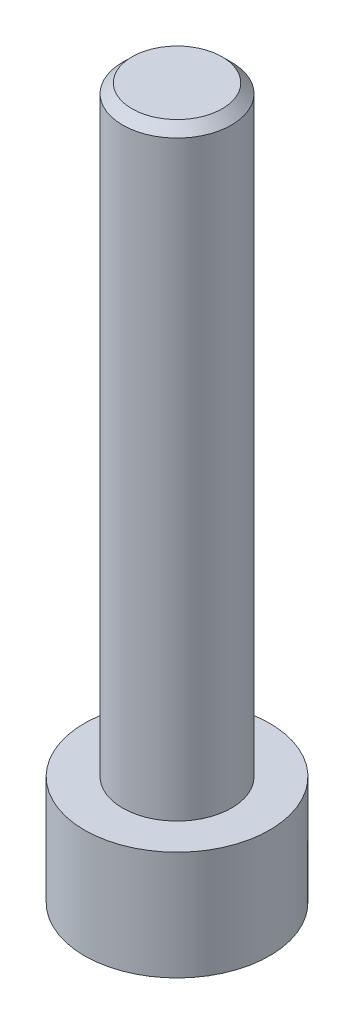
ISO-10303-21;
HEADER;
FILE_DESCRIPTION(('STEP AP214'),'2;1');
FILE_NAME('part.step','',(''),(''),'','','');
FILE_SCHEMA(('AUTOMOTIVE_DESIGN { 1 0 10303 214 1 1 1 1 }'));
ENDSEC;
DATA;
#1=APPLICATION_CONTEXT('core data for automotive mechanical design processes');
#2=APPLICATION_PROTOCOL_DEFINITION('international standard','automotive_design',2000,#1);
#3=PRODUCT_CONTEXT('',#1,'mechanical');
#4=PRODUCT('Part','Part','',(#3));
#5=PRODUCT_RELATED_PRODUCT_CATEGORY('part','',(#4));
#6=PRODUCT_DEFINITION_FORMATION('','',#4);
#7=PRODUCT_DEFINITION_CONTEXT('part definition',#1,'design');
#8=PRODUCT_DEFINITION('design','',#6,#7);
#9=PRODUCT_DEFINITION_SHAPE('','',#8);
#10=(LENGTH_UNIT() NAMED_UNIT(*) SI_UNIT(.MILLI.,.METRE.));
#11=(NAMED_UNIT(*) PLANE_ANGLE_UNIT() SI_UNIT($,.RADIAN.));
#12=(NAMED_UNIT(*) SI_UNIT($,.STERADIAN.) SOLID_ANGLE_UNIT());
#13=UNCERTAINTY_MEASURE_WITH_UNIT(LENGTH_MEASURE(1.E-05),#10,'distance_accuracy_value','');
#14=(GEOMETRIC_REPRESENTATION_CONTEXT(3) GLOBAL_UNCERTAINTY_ASSIGNED_CONTEXT((#13)) GLOBAL_UNIT_ASSIGNED_CONTEXT((#10,
#11,#12)) REPRESENTATION_CONTEXT('',''));
#15=CARTESIAN_POINT('',(0.,0.,0.));
#16=DIRECTION('',(0.,0.,1.));
#17=DIRECTION('',(1.,0.,0.));
#18=AXIS2_PLACEMENT_3D('',#15,#16,#17);
#19=CARTESIAN_POINT('',(0.,2.9,0.));
#20=DIRECTION('',(0.,-1.,0.));
#21=DIRECTION('',(0.,0.,-1.));
#22=AXIS2_PLACEMENT_3D('',#19,#20,#21);
#23=CYLINDRICAL_SURFACE('',#22,2.465);
#24=CARTESIAN_POINT('',(0.,2.9,0.));
#25=DIRECTION('',(0.,1.,0.));
#26=DIRECTION('',(0.,0.,1.));
#27=AXIS2_PLACEMENT_3D('',#24,#25,#26);
#28=CIRCLE('',#27,2.465);
#29=CARTESIAN_POINT('',(0.,2.9,2.465));
#30=VERTEX_POINT('',#29);
#31=EDGE_CURVE('E177',#30,#30,#28,.T.);
#32=ORIENTED_EDGE('',*,*,#31,.F.);
#33=EDGE_LOOP('',(#32));
#34=FACE_BOUND('',#33,.T.);
#35=CARTESIAN_POINT('',(0.,0.,0.));
#36=DIRECTION('',(0.,1.,0.));
#37=DIRECTION('',(0.,0.,1.));
#38=AXIS2_PLACEMENT_3D('',#35,#36,#37);
#39=CIRCLE('',#38,2.465);
#40=CARTESIAN_POINT('',(0.,0.,2.465));
#41=VERTEX_POINT('',#40);
#42=EDGE_CURVE('E163',#41,#41,#39,.T.);
#43=ORIENTED_EDGE('',*,*,#42,.T.);
#44=EDGE_LOOP('',(#43));
#45=FACE_BOUND('',#44,.T.);
#46=ADVANCED_FACE('F47',(#34,#45),#23,.T.);
#47=CARTESIAN_POINT('',(0.,2.9,0.));
#48=DIRECTION('',(0.,1.,0.));
#49=DIRECTION('',(0.,0.,1.));
#50=AXIS2_PLACEMENT_3D('',#47,#48,#49);
#51=PLANE('',#50);
#52=CARTESIAN_POINT('',(0.,2.9,0.));
#53=DIRECTION('',(0.,1.,0.));
#54=DIRECTION('',(0.,0.,1.));
#55=AXIS2_PLACEMENT_3D('',#52,#53,#54);
#56=CIRCLE('',#55,1.45);
#57=CARTESIAN_POINT('',(0.,2.9,1.45));
#58=VERTEX_POINT('',#57);
#59=EDGE_CURVE('E173',#58,#58,#56,.T.);
#60=ORIENTED_EDGE('',*,*,#59,.F.);
#61=EDGE_LOOP('',(#60));
#62=FACE_BOUND('',#61,.T.);
#63=ORIENTED_EDGE('',*,*,#31,.T.);
#64=EDGE_LOOP('',(#63));
#65=FACE_BOUND('',#64,.T.);
#66=ADVANCED_FACE('F199',(#62,#65),#51,.T.);
#67=CARTESIAN_POINT('',(0.,0.,0.));
#68=DIRECTION('',(0.,1.,0.));
#69=DIRECTION('',(0.,0.,1.));
#70=AXIS2_PLACEMENT_3D('',#67,#68,#69);
#71=PLANE('',#70);
#72=DIRECTION('',(0.5,0.,0.866025403784439));
#73=VECTOR('',#72,1.);
#74=CARTESIAN_POINT('',(0.733234841870825,0.,-1.27));
#75=LINE('',#74,#73);
#76=CARTESIAN_POINT('',(0.733234841870825,0.,-1.27));
#77=VERTEX_POINT('',#76);
#78=CARTESIAN_POINT('',(1.46646968374165,0.,0.));
#79=VERTEX_POINT('',#78);
#80=EDGE_CURVE('E144',#77,#79,#75,.T.);
#81=ORIENTED_EDGE('',*,*,#80,.F.);
#82=DIRECTION('',(1.,0.,0.));
#83=VECTOR('',#82,1.);
#84=CARTESIAN_POINT('',(-0.733234841870825,0.,-1.27));
#85=LINE('',#84,#83);
#86=CARTESIAN_POINT('',(-0.733234841870825,0.,-1.27));
#87=VERTEX_POINT('',#86);
#88=EDGE_CURVE('E64',#87,#77,#85,.T.);
#89=ORIENTED_EDGE('',*,*,#88,.F.);
#90=DIRECTION('',(0.5,0.,-0.866025403784438));
#91=VECTOR('',#90,1.);
#92=CARTESIAN_POINT('',(-1.46646968374165,0.,0.));
#93=LINE('',#92,#91);
#94=CARTESIAN_POINT('',(-1.46646968374165,0.,0.));
#95=VERTEX_POINT('',#94);
#96=EDGE_CURVE('E157',#95,#87,#93,.T.);
#97=ORIENTED_EDGE('',*,*,#96,.F.);
#98=DIRECTION('',(-0.5,0.,-0.866025403784439));
#99=VECTOR('',#98,1.);
#100=CARTESIAN_POINT('',(-0.733234841870825,0.,1.27));
#101=LINE('',#100,#99);
#102=CARTESIAN_POINT('',(-0.733234841870825,0.,1.27));
#103=VERTEX_POINT('',#102);
#104=EDGE_CURVE('E154',#103,#95,#101,.T.);
#105=ORIENTED_EDGE('',*,*,#104,.F.);
#106=DIRECTION('',(-1.,0.,0.));
#107=VECTOR('',#106,1.);
#108=CARTESIAN_POINT('',(0.733234841870825,0.,1.27));
#109=LINE('',#108,#107);
#110=CARTESIAN_POINT('',(0.733234841870825,0.,1.27));
#111=VERTEX_POINT('',#110);
#112=EDGE_CURVE('E112',#111,#103,#109,.T.);
#113=ORIENTED_EDGE('',*,*,#112,.F.);
#114=DIRECTION('',(-0.5,0.,0.866025403784439));
#115=VECTOR('',#114,1.);
#116=CARTESIAN_POINT('',(1.46646968374165,0.,0.));
#117=LINE('',#116,#115);
#118=EDGE_CURVE('E148',#79,#111,#117,.T.);
#119=ORIENTED_EDGE('',*,*,#118,.F.);
#120=EDGE_LOOP('',(#81,#89,#97,#105,#113,#119));
#121=FACE_BOUND('',#120,.T.);
#122=ORIENTED_EDGE('',*,*,#42,.F.);
#123=EDGE_LOOP('',(#122));
#124=FACE_BOUND('',#123,.T.);
#125=ADVANCED_FACE('F204',(#121,#124),#71,.F.);
#126=CARTESIAN_POINT('',(0.,18.9,0.));
#127=DIRECTION('',(0.,-1.,0.));
#128=DIRECTION('',(0.,0.,-1.));
#129=AXIS2_PLACEMENT_3D('',#126,#127,#128);
#130=CYLINDRICAL_SURFACE('',#129,1.45);
#131=CARTESIAN_POINT('',(0.,18.65,0.));
#132=DIRECTION('',(0.,1.,0.));
#133=DIRECTION('',(0.,0.,1.));
#134=AXIS2_PLACEMENT_3D('',#131,#132,#133);
#135=CIRCLE('',#134,1.45);
#136=CARTESIAN_POINT('',(0.,18.65,1.45));
#137=VERTEX_POINT('',#136);
#138=EDGE_CURVE('E11',#137,#137,#135,.F.);
#139=ORIENTED_EDGE('',*,*,#138,.T.);
#140=EDGE_LOOP('',(#139));
#141=FACE_BOUND('',#140,.T.);
#142=ORIENTED_EDGE('',*,*,#59,.T.);
#143=EDGE_LOOP('',(#142));
#144=FACE_BOUND('',#143,.T.);
#145=ADVANCED_FACE('F211',(#141,#144),#130,.T.);
#146=CARTESIAN_POINT('',(0.,18.9,0.));
#147=DIRECTION('',(0.,1.,0.));
#148=DIRECTION('',(0.,0.,1.));
#149=AXIS2_PLACEMENT_3D('',#146,#147,#148);
#150=PLANE('',#149);
#151=CARTESIAN_POINT('',(0.,18.9,0.));
#152=DIRECTION('',(0.,1.,0.));
#153=DIRECTION('',(0.,0.,1.));
#154=AXIS2_PLACEMENT_3D('',#151,#152,#153);
#155=CIRCLE('',#154,1.2);
#156=CARTESIAN_POINT('',(0.,18.9,1.2));
#157=VERTEX_POINT('',#156);
#158=EDGE_CURVE('E57',#157,#157,#155,.T.);
#159=ORIENTED_EDGE('',*,*,#158,.T.);
#160=EDGE_LOOP('',(#159));
#161=FACE_BOUND('',#160,.T.);
#162=ADVANCED_FACE('F187',(#161),#150,.T.);
#163=CARTESIAN_POINT('',(-0.733234841870825,1.9,-1.27));
#164=DIRECTION('',(0.,0.,-1.));
#165=DIRECTION('',(-1.,0.,0.));
#166=AXIS2_PLACEMENT_3D('',#163,#164,#165);
#167=PLANE('',#166);
#168=ORIENTED_EDGE('',*,*,#88,.T.);
#169=DIRECTION('',(0.,-1.,0.));
#170=VECTOR('',#169,1.);
#171=CARTESIAN_POINT('',(0.733234841870825,1.9,-1.27));
#172=LINE('',#171,#170);
#173=CARTESIAN_POINT('',(0.733234841870825,1.9,-1.27));
#174=VERTEX_POINT('',#173);
#175=EDGE_CURVE('E94',#174,#77,#172,.T.);
#176=ORIENTED_EDGE('',*,*,#175,.F.);
#177=DIRECTION('',(1.,0.,0.));
#178=VECTOR('',#177,1.);
#179=CARTESIAN_POINT('',(-0.733234841870825,1.9,-1.27));
#180=LINE('',#179,#178);
#181=CARTESIAN_POINT('',(-0.733234841870825,1.9,-1.27));
#182=VERTEX_POINT('',#181);
#183=EDGE_CURVE('E160',#182,#174,#180,.T.);
#184=ORIENTED_EDGE('',*,*,#183,.F.);
#185=DIRECTION('',(0.,-1.,0.));
#186=VECTOR('',#185,1.);
#187=CARTESIAN_POINT('',(-0.733234841870825,1.9,-1.27));
#188=LINE('',#187,#186);
#189=EDGE_CURVE('E72',#182,#87,#188,.T.);
#190=ORIENTED_EDGE('',*,*,#189,.T.);
#191=EDGE_LOOP('',(#168,#176,#184,#190));
#192=FACE_BOUND('',#191,.T.);
#193=ADVANCED_FACE('F218',(#192),#167,.F.);
#194=CARTESIAN_POINT('',(-1.46646968374165,1.9,0.));
#195=DIRECTION('',(-0.866025403784439,0.,-0.5));
#196=DIRECTION('',(-0.5,0.,0.866025403784439));
#197=AXIS2_PLACEMENT_3D('',#194,#195,#196);
#198=PLANE('',#197);
#199=ORIENTED_EDGE('',*,*,#96,.T.);
#200=ORIENTED_EDGE('',*,*,#189,.F.);
#201=DIRECTION('',(0.5,0.,-0.866025403784438));
#202=VECTOR('',#201,1.);
#203=CARTESIAN_POINT('',(-1.46646968374165,1.9,0.));
#204=LINE('',#203,#202);
#205=CARTESIAN_POINT('',(-1.46646968374165,1.9,0.));
#206=VERTEX_POINT('',#205);
#207=EDGE_CURVE('E126',#206,#182,#204,.T.);
#208=ORIENTED_EDGE('',*,*,#207,.F.);
#209=DIRECTION('',(0.,-1.,0.));
#210=VECTOR('',#209,1.);
#211=CARTESIAN_POINT('',(-1.46646968374165,1.9,0.));
#212=LINE('',#211,#210);
#213=EDGE_CURVE('E117',#206,#95,#212,.T.);
#214=ORIENTED_EDGE('',*,*,#213,.T.);
#215=EDGE_LOOP('',(#199,#200,#208,#214));
#216=FACE_BOUND('',#215,.T.);
#217=ADVANCED_FACE('F221',(#216),#198,.F.);
#218=CARTESIAN_POINT('',(-0.733234841870825,1.9,1.27));
#219=DIRECTION('',(-0.866025403784438,0.,0.5));
#220=DIRECTION('',(0.5,0.,0.866025403784439));
#221=AXIS2_PLACEMENT_3D('',#218,#219,#220);
#222=PLANE('',#221);
#223=ORIENTED_EDGE('',*,*,#104,.T.);
#224=ORIENTED_EDGE('',*,*,#213,.F.);
#225=DIRECTION('',(-0.5,0.,-0.866025403784439));
#226=VECTOR('',#225,1.);
#227=CARTESIAN_POINT('',(-0.733234841870825,1.9,1.27));
#228=LINE('',#227,#226);
#229=CARTESIAN_POINT('',(-0.733234841870825,1.9,1.27));
#230=VERTEX_POINT('',#229);
#231=EDGE_CURVE('E121',#230,#206,#228,.T.);
#232=ORIENTED_EDGE('',*,*,#231,.F.);
#233=DIRECTION('',(0.,-1.,0.));
#234=VECTOR('',#233,1.);
#235=CARTESIAN_POINT('',(-0.733234841870825,1.9,1.27));
#236=LINE('',#235,#234);
#237=EDGE_CURVE('E105',#230,#103,#236,.T.);
#238=ORIENTED_EDGE('',*,*,#237,.T.);
#239=EDGE_LOOP('',(#223,#224,#232,#238));
#240=FACE_BOUND('',#239,.T.);
#241=ADVANCED_FACE('F122',(#240),#222,.F.);
#242=CARTESIAN_POINT('',(0.733234841870825,1.9,1.27));
#243=DIRECTION('',(0.,0.,1.));
#244=DIRECTION('',(1.,0.,0.));
#245=AXIS2_PLACEMENT_3D('',#242,#243,#244);
#246=PLANE('',#245);
#247=ORIENTED_EDGE('',*,*,#112,.T.);
#248=ORIENTED_EDGE('',*,*,#237,.F.);
#249=DIRECTION('',(-1.,0.,0.));
#250=VECTOR('',#249,1.);
#251=CARTESIAN_POINT('',(0.733234841870825,1.9,1.27));
#252=LINE('',#251,#250);
#253=CARTESIAN_POINT('',(0.733234841870825,1.9,1.27));
#254=VERTEX_POINT('',#253);
#255=EDGE_CURVE('E109',#254,#230,#252,.T.);
#256=ORIENTED_EDGE('',*,*,#255,.F.);
#257=DIRECTION('',(0.,-1.,0.));
#258=VECTOR('',#257,1.);
#259=CARTESIAN_POINT('',(0.733234841870825,1.9,1.27));
#260=LINE('',#259,#258);
#261=EDGE_CURVE('E118',#254,#111,#260,.T.);
#262=ORIENTED_EDGE('',*,*,#261,.T.);
#263=EDGE_LOOP('',(#247,#248,#256,#262));
#264=FACE_BOUND('',#263,.T.);
#265=ADVANCED_FACE('F107',(#264),#246,.F.);
#266=CARTESIAN_POINT('',(1.46646968374165,1.9,0.));
#267=DIRECTION('',(0.866025403784438,0.,0.5));
#268=DIRECTION('',(0.5,0.,-0.866025403784439));
#269=AXIS2_PLACEMENT_3D('',#266,#267,#268);
#270=PLANE('',#269);
#271=ORIENTED_EDGE('',*,*,#118,.T.);
#272=ORIENTED_EDGE('',*,*,#261,.F.);
#273=DIRECTION('',(-0.5,0.,0.866025403784439));
#274=VECTOR('',#273,1.);
#275=CARTESIAN_POINT('',(1.46646968374165,1.9,0.));
#276=LINE('',#275,#274);
#277=CARTESIAN_POINT('',(1.46646968374165,1.9,0.));
#278=VERTEX_POINT('',#277);
#279=EDGE_CURVE('E132',#278,#254,#276,.T.);
#280=ORIENTED_EDGE('',*,*,#279,.F.);
#281=DIRECTION('',(0.,-1.,0.));
#282=VECTOR('',#281,1.);
#283=CARTESIAN_POINT('',(1.46646968374165,1.9,0.));
#284=LINE('',#283,#282);
#285=EDGE_CURVE('E168',#278,#79,#284,.T.);
#286=ORIENTED_EDGE('',*,*,#285,.T.);
#287=EDGE_LOOP('',(#271,#272,#280,#286));
#288=FACE_BOUND('',#287,.T.);
#289=ADVANCED_FACE('F224',(#288),#270,.F.);
#290=CARTESIAN_POINT('',(0.733234841870825,1.9,-1.27));
#291=DIRECTION('',(0.866025403784438,0.,-0.5));
#292=DIRECTION('',(-0.5,0.,-0.866025403784439));
#293=AXIS2_PLACEMENT_3D('',#290,#291,#292);
#294=PLANE('',#293);
#295=ORIENTED_EDGE('',*,*,#80,.T.);
#296=ORIENTED_EDGE('',*,*,#285,.F.);
#297=DIRECTION('',(0.5,0.,0.866025403784439));
#298=VECTOR('',#297,1.);
#299=CARTESIAN_POINT('',(0.733234841870825,1.9,-1.27));
#300=LINE('',#299,#298);
#301=EDGE_CURVE('E136',#174,#278,#300,.T.);
#302=ORIENTED_EDGE('',*,*,#301,.F.);
#303=ORIENTED_EDGE('',*,*,#175,.T.);
#304=EDGE_LOOP('',(#295,#296,#302,#303));
#305=FACE_BOUND('',#304,.T.);
#306=ADVANCED_FACE('F195',(#305),#294,.F.);
#307=CARTESIAN_POINT('',(0.,1.9,0.));
#308=DIRECTION('',(0.,-1.,0.));
#309=DIRECTION('',(0.,0.,-1.));
#310=AXIS2_PLACEMENT_3D('',#307,#308,#309);
#311=PLANE('',#310);
#312=ORIENTED_EDGE('',*,*,#183,.T.);
#313=ORIENTED_EDGE('',*,*,#301,.T.);
#314=ORIENTED_EDGE('',*,*,#279,.T.);
#315=ORIENTED_EDGE('',*,*,#255,.T.);
#316=ORIENTED_EDGE('',*,*,#231,.T.);
#317=ORIENTED_EDGE('',*,*,#207,.T.);
#318=EDGE_LOOP('',(#312,#313,#314,#315,#316,#317));
#319=FACE_BOUND('',#318,.T.);
#320=ADVANCED_FACE('F129',(#319),#311,.T.);
#321=CARTESIAN_POINT('',(0.,18.9,0.));
#322=DIRECTION('',(0.,-1.,0.));
#323=DIRECTION('',(0.,0.,-1.));
#324=AXIS2_PLACEMENT_3D('',#321,#322,#323);
#325=CONICAL_SURFACE('',#324,1.2,0.785398163397455);
#326=ORIENTED_EDGE('',*,*,#138,.F.);
#327=EDGE_LOOP('',(#326));
#328=FACE_BOUND('',#327,.T.);
#329=ORIENTED_EDGE('',*,*,#158,.F.);
#330=EDGE_LOOP('',(#329));
#331=FACE_BOUND('',#330,.T.);
#332=ADVANCED_FACE('F50',(#328,#331),#325,.T.);
#333=CLOSED_SHELL('',(#46,#66,#125,#145,#162,#193,#217,#241,#265,#289,#306,#320,#332));
#334=MANIFOLD_SOLID_BREP('B2',#333);
#335=ADVANCED_BREP_SHAPE_REPRESENTATION('',(#18,#334),#14);
#336=SHAPE_DEFINITION_REPRESENTATION(#9,#335);
ENDSEC;
END-ISO-10303-21;
